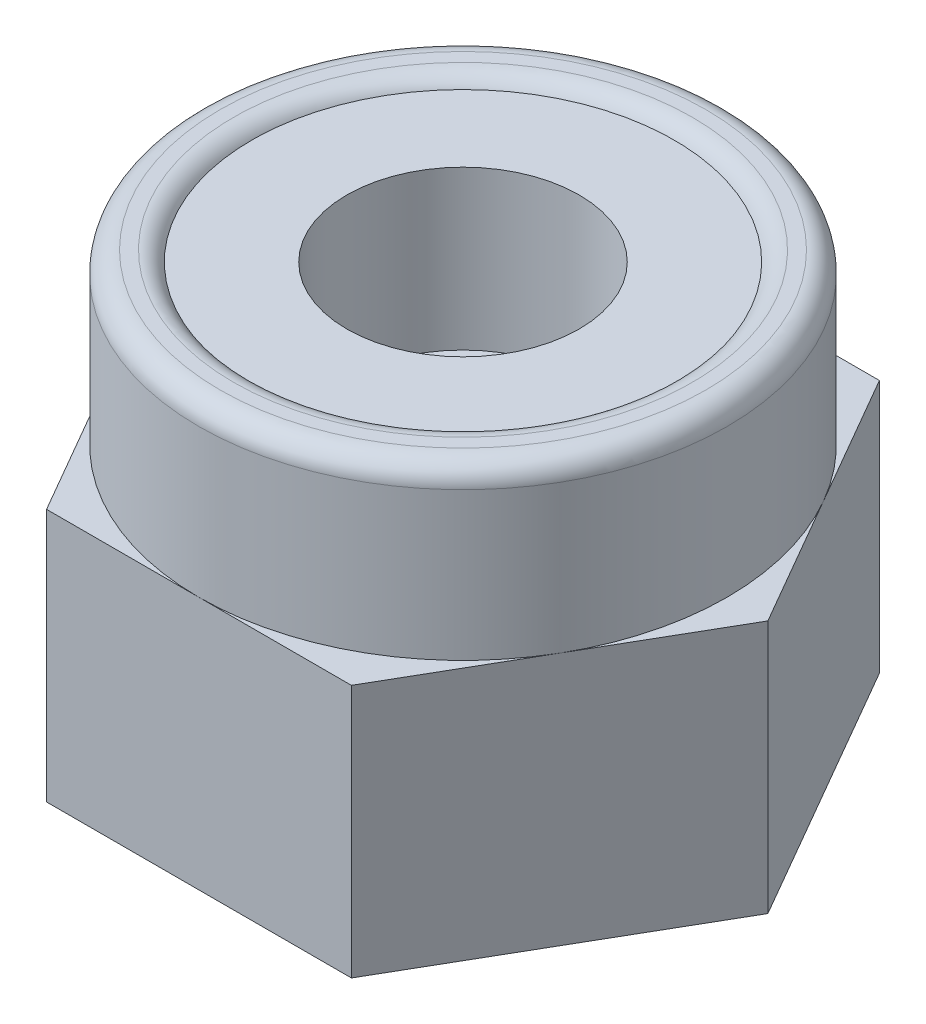
ISO-10303-21;
HEADER;
FILE_DESCRIPTION(('STEP AP214'),'2;1');
FILE_NAME('part.step','',(''),(''),'','','');
FILE_SCHEMA(('AUTOMOTIVE_DESIGN { 1 0 10303 214 1 1 1 1 }'));
ENDSEC;
DATA;
#1=APPLICATION_CONTEXT('core data for automotive mechanical design processes');
#2=APPLICATION_PROTOCOL_DEFINITION('international standard','automotive_design',2000,#1);
#3=PRODUCT_CONTEXT('',#1,'mechanical');
#4=PRODUCT('Part','Part','',(#3));
#5=PRODUCT_RELATED_PRODUCT_CATEGORY('part','',(#4));
#6=PRODUCT_DEFINITION_FORMATION('','',#4);
#7=PRODUCT_DEFINITION_CONTEXT('part definition',#1,'design');
#8=PRODUCT_DEFINITION('design','',#6,#7);
#9=PRODUCT_DEFINITION_SHAPE('','',#8);
#10=(LENGTH_UNIT() NAMED_UNIT(*) SI_UNIT(.MILLI.,.METRE.));
#11=(NAMED_UNIT(*) PLANE_ANGLE_UNIT() SI_UNIT($,.RADIAN.));
#12=(NAMED_UNIT(*) SI_UNIT($,.STERADIAN.) SOLID_ANGLE_UNIT());
#13=UNCERTAINTY_MEASURE_WITH_UNIT(LENGTH_MEASURE(1.E-05),#10,'distance_accuracy_value','');
#14=(GEOMETRIC_REPRESENTATION_CONTEXT(3) GLOBAL_UNCERTAINTY_ASSIGNED_CONTEXT((#13)) GLOBAL_UNIT_ASSIGNED_CONTEXT((#10,
#11,#12)) REPRESENTATION_CONTEXT('',''));
#15=CARTESIAN_POINT('',(0.,0.,0.));
#16=DIRECTION('',(0.,0.,1.));
#17=DIRECTION('',(1.,0.,0.));
#18=AXIS2_PLACEMENT_3D('',#15,#16,#17);
#19=CARTESIAN_POINT('',(0.,4.,0.));
#20=DIRECTION('',(0.,-1.,0.));
#21=DIRECTION('',(0.,0.,-1.));
#22=AXIS2_PLACEMENT_3D('',#19,#20,#21);
#23=CYLINDRICAL_SURFACE('',#22,1.1);
#24=CARTESIAN_POINT('',(0.,2.4,0.));
#25=DIRECTION('',(0.,1.,0.));
#26=DIRECTION('',(0.,0.,1.));
#27=AXIS2_PLACEMENT_3D('',#24,#25,#26);
#28=CIRCLE('',#27,1.1);
#29=CARTESIAN_POINT('',(0.,2.4,1.1));
#30=VERTEX_POINT('',#29);
#31=EDGE_CURVE('E134',#30,#30,#28,.T.);
#32=ORIENTED_EDGE('',*,*,#31,.F.);
#33=EDGE_LOOP('',(#32));
#34=FACE_BOUND('',#33,.T.);
#35=CARTESIAN_POINT('',(0.,3.9,0.));
#36=DIRECTION('',(0.,1.,0.));
#37=DIRECTION('',(0.,0.,1.));
#38=AXIS2_PLACEMENT_3D('',#35,#36,#37);
#39=CIRCLE('',#38,1.1);
#40=CARTESIAN_POINT('',(0.,3.9,1.1));
#41=VERTEX_POINT('',#40);
#42=EDGE_CURVE('E411',#41,#41,#39,.T.);
#43=ORIENTED_EDGE('',*,*,#42,.T.);
#44=EDGE_LOOP('',(#43));
#45=FACE_BOUND('',#44,.T.);
#46=ADVANCED_FACE('F34',(#34,#45),#23,.F.);
#47=CARTESIAN_POINT('',(-1.44337567297406,2.4,-2.5));
#48=DIRECTION('',(0.,1.,0.));
#49=DIRECTION('',(0.,0.,1.));
#50=AXIS2_PLACEMENT_3D('',#47,#48,#49);
#51=PLANE('',#50);
#52=CARTESIAN_POINT('',(0.,2.4,0.));
#53=DIRECTION('',(0.,1.,0.));
#54=DIRECTION('',(0.,0.,1.));
#55=AXIS2_PLACEMENT_3D('',#52,#53,#54);
#56=CIRCLE('',#55,2.5);
#57=CARTESIAN_POINT('',(0.,2.4,2.5));
#58=VERTEX_POINT('',#57);
#59=CARTESIAN_POINT('',(2.1650635094611,2.4,1.25));
#60=VERTEX_POINT('',#59);
#61=EDGE_CURVE('E129',#58,#60,#56,.T.);
#62=ORIENTED_EDGE('',*,*,#61,.F.);
#63=DIRECTION('',(1.,0.,0.));
#64=VECTOR('',#63,1.);
#65=CARTESIAN_POINT('',(-1.44337567297407,2.4,2.5));
#66=LINE('',#65,#64);
#67=CARTESIAN_POINT('',(1.44337567297406,2.4,2.5));
#68=VERTEX_POINT('',#67);
#69=EDGE_CURVE('E117',#58,#68,#66,.T.);
#70=ORIENTED_EDGE('',*,*,#69,.T.);
#71=DIRECTION('',(0.5,0.,-0.866025403784439));
#72=VECTOR('',#71,1.);
#73=CARTESIAN_POINT('',(1.44337567297406,2.4,2.5));
#74=LINE('',#73,#72);
#75=EDGE_CURVE('E131',#68,#60,#74,.T.);
#76=ORIENTED_EDGE('',*,*,#75,.T.);
#77=EDGE_LOOP('',(#62,#70,#76));
#78=FACE_BOUND('',#77,.T.);
#79=ADVANCED_FACE('F130',(#78),#51,.T.);
#80=CARTESIAN_POINT('',(2.1650635094611,2.4,-1.25));
#81=VERTEX_POINT('',#80);
#82=EDGE_CURVE('E57',#60,#81,#56,.T.);
#83=ORIENTED_EDGE('',*,*,#82,.F.);
#84=CARTESIAN_POINT('',(2.88675134594813,2.4,0.));
#85=VERTEX_POINT('',#84);
#86=EDGE_CURVE('E116',#60,#85,#74,.T.);
#87=ORIENTED_EDGE('',*,*,#86,.T.);
#88=DIRECTION('',(-0.5,0.,-0.866025403784439));
#89=VECTOR('',#88,1.);
#90=CARTESIAN_POINT('',(2.88675134594813,2.4,0.));
#91=LINE('',#90,#89);
#92=EDGE_CURVE('E165',#85,#81,#91,.T.);
#93=ORIENTED_EDGE('',*,*,#92,.T.);
#94=EDGE_LOOP('',(#83,#87,#93));
#95=FACE_BOUND('',#94,.T.);
#96=ADVANCED_FACE('F217',(#95),#51,.T.);
#97=CARTESIAN_POINT('',(0.,2.4,-2.5));
#98=VERTEX_POINT('',#97);
#99=EDGE_CURVE('E49',#81,#98,#56,.T.);
#100=ORIENTED_EDGE('',*,*,#99,.F.);
#101=CARTESIAN_POINT('',(1.44337567297407,2.4,-2.5));
#102=VERTEX_POINT('',#101);
#103=EDGE_CURVE('E164',#81,#102,#91,.T.);
#104=ORIENTED_EDGE('',*,*,#103,.T.);
#105=DIRECTION('',(-1.,0.,0.));
#106=VECTOR('',#105,1.);
#107=CARTESIAN_POINT('',(1.44337567297407,2.4,-2.5));
#108=LINE('',#107,#106);
#109=EDGE_CURVE('E154',#102,#98,#108,.T.);
#110=ORIENTED_EDGE('',*,*,#109,.T.);
#111=EDGE_LOOP('',(#100,#104,#110));
#112=FACE_BOUND('',#111,.T.);
#113=ADVANCED_FACE('F274',(#112),#51,.T.);
#114=CARTESIAN_POINT('',(-2.1650635094611,2.4,-1.25));
#115=VERTEX_POINT('',#114);
#116=EDGE_CURVE('E141',#98,#115,#56,.T.);
#117=ORIENTED_EDGE('',*,*,#116,.F.);
#118=CARTESIAN_POINT('',(-1.44337567297406,2.4,-2.5));
#119=VERTEX_POINT('',#118);
#120=EDGE_CURVE('E157',#98,#119,#108,.T.);
#121=ORIENTED_EDGE('',*,*,#120,.T.);
#122=DIRECTION('',(-0.5,0.,0.866025403784439));
#123=VECTOR('',#122,1.);
#124=CARTESIAN_POINT('',(-1.44337567297406,2.4,-2.5));
#125=LINE('',#124,#123);
#126=EDGE_CURVE('E158',#119,#115,#125,.T.);
#127=ORIENTED_EDGE('',*,*,#126,.T.);
#128=EDGE_LOOP('',(#117,#121,#127));
#129=FACE_BOUND('',#128,.T.);
#130=ADVANCED_FACE('F273',(#129),#51,.T.);
#131=CARTESIAN_POINT('',(-2.1650635094611,2.4,1.25));
#132=VERTEX_POINT('',#131);
#133=EDGE_CURVE('E139',#115,#132,#56,.T.);
#134=ORIENTED_EDGE('',*,*,#133,.F.);
#135=CARTESIAN_POINT('',(-2.88675134594813,2.4,0.));
#136=VERTEX_POINT('',#135);
#137=EDGE_CURVE('E156',#115,#136,#125,.T.);
#138=ORIENTED_EDGE('',*,*,#137,.T.);
#139=DIRECTION('',(0.5,0.,0.866025403784439));
#140=VECTOR('',#139,1.);
#141=CARTESIAN_POINT('',(-2.88675134594813,2.4,0.));
#142=LINE('',#141,#140);
#143=EDGE_CURVE('E127',#136,#132,#142,.T.);
#144=ORIENTED_EDGE('',*,*,#143,.T.);
#145=EDGE_LOOP('',(#134,#138,#144));
#146=FACE_BOUND('',#145,.T.);
#147=ADVANCED_FACE('F279',(#146),#51,.T.);
#148=CARTESIAN_POINT('',(0.,2.4,0.));
#149=DIRECTION('',(0.,1.,0.));
#150=DIRECTION('',(0.,0.,1.));
#151=AXIS2_PLACEMENT_3D('',#148,#149,#150);
#152=CIRCLE('',#151,1.);
#153=CARTESIAN_POINT('',(0.,2.4,1.));
#154=VERTEX_POINT('',#153);
#155=EDGE_CURVE('E148',#154,#154,#152,.T.);
#156=ORIENTED_EDGE('',*,*,#155,.F.);
#157=EDGE_LOOP('',(#156));
#158=FACE_BOUND('',#157,.T.);
#159=ORIENTED_EDGE('',*,*,#31,.T.);
#160=EDGE_LOOP('',(#159));
#161=FACE_BOUND('',#160,.T.);
#162=ADVANCED_FACE('F234',(#158,#161),#51,.T.);
#163=EDGE_CURVE('E110',#132,#58,#56,.T.);
#164=ORIENTED_EDGE('',*,*,#163,.F.);
#165=CARTESIAN_POINT('',(-1.44337567297407,2.4,2.5));
#166=VERTEX_POINT('',#165);
#167=EDGE_CURVE('E112',#132,#166,#142,.T.);
#168=ORIENTED_EDGE('',*,*,#167,.T.);
#169=EDGE_CURVE('E106',#166,#58,#66,.T.);
#170=ORIENTED_EDGE('',*,*,#169,.T.);
#171=EDGE_LOOP('',(#164,#168,#170));
#172=FACE_BOUND('',#171,.T.);
#173=ADVANCED_FACE('F108',(#172),#51,.T.);
#174=CARTESIAN_POINT('',(-1.44337567297406,0.,-2.5));
#175=DIRECTION('',(0.,1.,0.));
#176=DIRECTION('',(0.,0.,1.));
#177=AXIS2_PLACEMENT_3D('',#174,#175,#176);
#178=PLANE('',#177);
#179=DIRECTION('',(-1.,0.,0.));
#180=VECTOR('',#179,1.);
#181=CARTESIAN_POINT('',(1.44337567297407,0.,-2.5));
#182=LINE('',#181,#180);
#183=CARTESIAN_POINT('',(1.44337567297407,0.,-2.5));
#184=VERTEX_POINT('',#183);
#185=CARTESIAN_POINT('',(-1.44337567297406,0.,-2.5));
#186=VERTEX_POINT('',#185);
#187=EDGE_CURVE('E151',#184,#186,#182,.T.);
#188=ORIENTED_EDGE('',*,*,#187,.F.);
#189=DIRECTION('',(-0.5,0.,-0.866025403784439));
#190=VECTOR('',#189,1.);
#191=CARTESIAN_POINT('',(2.88675134594813,0.,0.));
#192=LINE('',#191,#190);
#193=CARTESIAN_POINT('',(2.88675134594813,0.,0.));
#194=VERTEX_POINT('',#193);
#195=EDGE_CURVE('E178',#194,#184,#192,.T.);
#196=ORIENTED_EDGE('',*,*,#195,.F.);
#197=DIRECTION('',(0.5,0.,-0.866025403784439));
#198=VECTOR('',#197,1.);
#199=CARTESIAN_POINT('',(1.44337567297406,0.,2.5));
#200=LINE('',#199,#198);
#201=CARTESIAN_POINT('',(1.44337567297406,0.,2.5));
#202=VERTEX_POINT('',#201);
#203=EDGE_CURVE('E176',#202,#194,#200,.T.);
#204=ORIENTED_EDGE('',*,*,#203,.F.);
#205=DIRECTION('',(1.,0.,0.));
#206=VECTOR('',#205,1.);
#207=CARTESIAN_POINT('',(-1.44337567297407,0.,2.5));
#208=LINE('',#207,#206);
#209=CARTESIAN_POINT('',(-1.44337567297407,0.,2.5));
#210=VERTEX_POINT('',#209);
#211=EDGE_CURVE('E174',#210,#202,#208,.T.);
#212=ORIENTED_EDGE('',*,*,#211,.F.);
#213=DIRECTION('',(0.5,0.,0.866025403784439));
#214=VECTOR('',#213,1.);
#215=CARTESIAN_POINT('',(-2.88675134594813,0.,0.));
#216=LINE('',#215,#214);
#217=CARTESIAN_POINT('',(-2.88675134594813,0.,0.));
#218=VERTEX_POINT('',#217);
#219=EDGE_CURVE('E172',#218,#210,#216,.T.);
#220=ORIENTED_EDGE('',*,*,#219,.F.);
#221=DIRECTION('',(-0.5,0.,0.866025403784439));
#222=VECTOR('',#221,1.);
#223=CARTESIAN_POINT('',(-1.44337567297406,0.,-2.5));
#224=LINE('',#223,#222);
#225=EDGE_CURVE('E170',#186,#218,#224,.T.);
#226=ORIENTED_EDGE('',*,*,#225,.F.);
#227=EDGE_LOOP('',(#188,#196,#204,#212,#220,#226));
#228=FACE_BOUND('',#227,.T.);
#229=CARTESIAN_POINT('',(0.,0.,0.));
#230=DIRECTION('',(0.,1.,0.));
#231=DIRECTION('',(0.,0.,1.));
#232=AXIS2_PLACEMENT_3D('',#229,#230,#231);
#233=CIRCLE('',#232,1.);
#234=CARTESIAN_POINT('',(0.,0.,1.));
#235=VERTEX_POINT('',#234);
#236=EDGE_CURVE('E133',#235,#235,#233,.T.);
#237=ORIENTED_EDGE('',*,*,#236,.T.);
#238=EDGE_LOOP('',(#237));
#239=FACE_BOUND('',#238,.T.);
#240=ADVANCED_FACE('F233',(#228,#239),#178,.F.);
#241=CARTESIAN_POINT('',(1.44337567297407,2.4,-2.5));
#242=DIRECTION('',(0.,0.,1.));
#243=DIRECTION('',(1.,0.,0.));
#244=AXIS2_PLACEMENT_3D('',#241,#242,#243);
#245=PLANE('',#244);
#246=ORIENTED_EDGE('',*,*,#187,.T.);
#247=DIRECTION('',(0.,-1.,0.));
#248=VECTOR('',#247,1.);
#249=CARTESIAN_POINT('',(-1.44337567297406,2.4,-2.5));
#250=LINE('',#249,#248);
#251=EDGE_CURVE('E140',#119,#186,#250,.T.);
#252=ORIENTED_EDGE('',*,*,#251,.F.);
#253=ORIENTED_EDGE('',*,*,#120,.F.);
#254=ORIENTED_EDGE('',*,*,#109,.F.);
#255=DIRECTION('',(0.,-1.,0.));
#256=VECTOR('',#255,1.);
#257=CARTESIAN_POINT('',(1.44337567297407,2.4,-2.5));
#258=LINE('',#257,#256);
#259=EDGE_CURVE('E167',#102,#184,#258,.T.);
#260=ORIENTED_EDGE('',*,*,#259,.T.);
#261=EDGE_LOOP('',(#246,#252,#253,#254,#260));
#262=FACE_BOUND('',#261,.T.);
#263=ADVANCED_FACE('F237',(#262),#245,.F.);
#264=CARTESIAN_POINT('',(-1.44337567297406,2.4,-2.5));
#265=DIRECTION('',(0.866025403784439,0.,0.5));
#266=DIRECTION('',(0.5,0.,-0.866025403784439));
#267=AXIS2_PLACEMENT_3D('',#264,#265,#266);
#268=PLANE('',#267);
#269=ORIENTED_EDGE('',*,*,#225,.T.);
#270=DIRECTION('',(0.,-1.,0.));
#271=VECTOR('',#270,1.);
#272=CARTESIAN_POINT('',(-2.88675134594813,2.4,0.));
#273=LINE('',#272,#271);
#274=EDGE_CURVE('E143',#136,#218,#273,.T.);
#275=ORIENTED_EDGE('',*,*,#274,.F.);
#276=ORIENTED_EDGE('',*,*,#137,.F.);
#277=ORIENTED_EDGE('',*,*,#126,.F.);
#278=ORIENTED_EDGE('',*,*,#251,.T.);
#279=EDGE_LOOP('',(#269,#275,#276,#277,#278));
#280=FACE_BOUND('',#279,.T.);
#281=ADVANCED_FACE('F251',(#280),#268,.F.);
#282=CARTESIAN_POINT('',(-2.88675134594813,2.4,0.));
#283=DIRECTION('',(0.866025403784439,0.,-0.5));
#284=DIRECTION('',(-0.5,0.,-0.866025403784439));
#285=AXIS2_PLACEMENT_3D('',#282,#283,#284);
#286=PLANE('',#285);
#287=ORIENTED_EDGE('',*,*,#219,.T.);
#288=DIRECTION('',(0.,-1.,0.));
#289=VECTOR('',#288,1.);
#290=CARTESIAN_POINT('',(-1.44337567297407,2.4,2.5));
#291=LINE('',#290,#289);
#292=EDGE_CURVE('E186',#166,#210,#291,.T.);
#293=ORIENTED_EDGE('',*,*,#292,.F.);
#294=ORIENTED_EDGE('',*,*,#167,.F.);
#295=ORIENTED_EDGE('',*,*,#143,.F.);
#296=ORIENTED_EDGE('',*,*,#274,.T.);
#297=EDGE_LOOP('',(#287,#293,#294,#295,#296));
#298=FACE_BOUND('',#297,.T.);
#299=ADVANCED_FACE('F248',(#298),#286,.F.);
#300=CARTESIAN_POINT('',(-1.44337567297407,2.4,2.5));
#301=DIRECTION('',(0.,0.,-1.));
#302=DIRECTION('',(-1.,0.,0.));
#303=AXIS2_PLACEMENT_3D('',#300,#301,#302);
#304=PLANE('',#303);
#305=ORIENTED_EDGE('',*,*,#211,.T.);
#306=DIRECTION('',(0.,-1.,0.));
#307=VECTOR('',#306,1.);
#308=CARTESIAN_POINT('',(1.44337567297406,2.4,2.5));
#309=LINE('',#308,#307);
#310=EDGE_CURVE('E123',#68,#202,#309,.T.);
#311=ORIENTED_EDGE('',*,*,#310,.F.);
#312=ORIENTED_EDGE('',*,*,#69,.F.);
#313=ORIENTED_EDGE('',*,*,#169,.F.);
#314=ORIENTED_EDGE('',*,*,#292,.T.);
#315=EDGE_LOOP('',(#305,#311,#312,#313,#314));
#316=FACE_BOUND('',#315,.T.);
#317=ADVANCED_FACE('F121',(#316),#304,.F.);
#318=CARTESIAN_POINT('',(1.44337567297406,2.4,2.5));
#319=DIRECTION('',(-0.866025403784439,0.,-0.5));
#320=DIRECTION('',(-0.5,0.,0.866025403784439));
#321=AXIS2_PLACEMENT_3D('',#318,#319,#320);
#322=PLANE('',#321);
#323=ORIENTED_EDGE('',*,*,#203,.T.);
#324=DIRECTION('',(0.,-1.,0.));
#325=VECTOR('',#324,1.);
#326=CARTESIAN_POINT('',(2.88675134594813,2.4,0.));
#327=LINE('',#326,#325);
#328=EDGE_CURVE('E182',#85,#194,#327,.T.);
#329=ORIENTED_EDGE('',*,*,#328,.F.);
#330=ORIENTED_EDGE('',*,*,#86,.F.);
#331=ORIENTED_EDGE('',*,*,#75,.F.);
#332=ORIENTED_EDGE('',*,*,#310,.T.);
#333=EDGE_LOOP('',(#323,#329,#330,#331,#332));
#334=FACE_BOUND('',#333,.T.);
#335=ADVANCED_FACE('F241',(#334),#322,.F.);
#336=CARTESIAN_POINT('',(2.88675134594813,2.4,0.));
#337=DIRECTION('',(-0.866025403784439,0.,0.5));
#338=DIRECTION('',(0.5,0.,0.866025403784439));
#339=AXIS2_PLACEMENT_3D('',#336,#337,#338);
#340=PLANE('',#339);
#341=ORIENTED_EDGE('',*,*,#195,.T.);
#342=ORIENTED_EDGE('',*,*,#259,.F.);
#343=ORIENTED_EDGE('',*,*,#103,.F.);
#344=ORIENTED_EDGE('',*,*,#92,.F.);
#345=ORIENTED_EDGE('',*,*,#328,.T.);
#346=EDGE_LOOP('',(#341,#342,#343,#344,#345));
#347=FACE_BOUND('',#346,.T.);
#348=ADVANCED_FACE('F229',(#347),#340,.F.);
#349=CARTESIAN_POINT('',(0.,2.4,0.));
#350=DIRECTION('',(0.,-1.,0.));
#351=DIRECTION('',(0.,0.,-1.));
#352=AXIS2_PLACEMENT_3D('',#349,#350,#351);
#353=CYLINDRICAL_SURFACE('',#352,1.);
#354=ORIENTED_EDGE('',*,*,#155,.T.);
#355=EDGE_LOOP('',(#354));
#356=FACE_BOUND('',#355,.T.);
#357=ORIENTED_EDGE('',*,*,#236,.F.);
#358=EDGE_LOOP('',(#357));
#359=FACE_BOUND('',#358,.T.);
#360=ADVANCED_FACE('F224',(#356,#359),#353,.F.);
#361=CARTESIAN_POINT('',(0.,4.,0.));
#362=DIRECTION('',(0.,1.,0.));
#363=DIRECTION('',(0.,0.,1.));
#364=AXIS2_PLACEMENT_3D('',#361,#362,#363);
#365=PLANE('',#364);
#366=CARTESIAN_POINT('',(0.,4.,0.));
#367=DIRECTION('',(0.,1.,0.));
#368=DIRECTION('',(0.,0.,1.));
#369=AXIS2_PLACEMENT_3D('',#366,#367,#368);
#370=CIRCLE('',#369,2.3);
#371=CARTESIAN_POINT('',(0.,4.,2.3));
#372=VERTEX_POINT('',#371);
#373=EDGE_CURVE('E42',#372,#372,#370,.T.);
#374=ORIENTED_EDGE('',*,*,#373,.T.);
#375=EDGE_LOOP('',(#374));
#376=FACE_BOUND('',#375,.T.);
#377=CARTESIAN_POINT('',(0.,4.,0.));
#378=DIRECTION('',(0.,1.,0.));
#379=DIRECTION('',(0.,0.,1.));
#380=AXIS2_PLACEMENT_3D('',#377,#378,#379);
#381=CIRCLE('',#380,2.17320508075689);
#382=CARTESIAN_POINT('',(0.,4.,2.17320508075689));
#383=VERTEX_POINT('',#382);
#384=EDGE_CURVE('E190',#383,#383,#381,.F.);
#385=ORIENTED_EDGE('',*,*,#384,.T.);
#386=EDGE_LOOP('',(#385));
#387=FACE_BOUND('',#386,.T.);
#388=ADVANCED_FACE('F195',(#376,#387),#365,.T.);
#389=CARTESIAN_POINT('',(0.,4.,0.));
#390=DIRECTION('',(0.,-1.,0.));
#391=DIRECTION('',(0.,0.,-1.));
#392=AXIS2_PLACEMENT_3D('',#389,#390,#391);
#393=CYLINDRICAL_SURFACE('',#392,2.5);
#394=CARTESIAN_POINT('',(0.,3.8,0.));
#395=DIRECTION('',(0.,1.,0.));
#396=DIRECTION('',(0.,0.,1.));
#397=AXIS2_PLACEMENT_3D('',#394,#395,#396);
#398=CIRCLE('',#397,2.5);
#399=CARTESIAN_POINT('',(0.,3.8,2.5));
#400=VERTEX_POINT('',#399);
#401=EDGE_CURVE('E11',#400,#400,#398,.F.);
#402=ORIENTED_EDGE('',*,*,#401,.T.);
#403=EDGE_LOOP('',(#402));
#404=FACE_BOUND('',#403,.T.);
#405=ORIENTED_EDGE('',*,*,#61,.T.);
#406=ORIENTED_EDGE('',*,*,#82,.T.);
#407=ORIENTED_EDGE('',*,*,#99,.T.);
#408=ORIENTED_EDGE('',*,*,#116,.T.);
#409=ORIENTED_EDGE('',*,*,#133,.T.);
#410=ORIENTED_EDGE('',*,*,#163,.T.);
#411=EDGE_LOOP('',(#405,#406,#407,#408,#409,#410));
#412=FACE_BOUND('',#411,.T.);
#413=ADVANCED_FACE('F137',(#404,#412),#393,.T.);
#414=CARTESIAN_POINT('',(0.,3.9,0.));
#415=DIRECTION('',(0.,1.,0.));
#416=DIRECTION('',(0.,0.,1.));
#417=AXIS2_PLACEMENT_3D('',#414,#415,#416);
#418=PLANE('',#417);
#419=ORIENTED_EDGE('',*,*,#42,.F.);
#420=EDGE_LOOP('',(#419));
#421=FACE_BOUND('',#420,.T.);
#422=CARTESIAN_POINT('',(0.,3.9,0.));
#423=DIRECTION('',(0.,1.,0.));
#424=DIRECTION('',(0.,0.,1.));
#425=AXIS2_PLACEMENT_3D('',#422,#423,#424);
#426=CIRCLE('',#425,2.);
#427=CARTESIAN_POINT('',(0.,3.9,2.));
#428=VERTEX_POINT('',#427);
#429=EDGE_CURVE('E409',#428,#428,#426,.T.);
#430=ORIENTED_EDGE('',*,*,#429,.T.);
#431=EDGE_LOOP('',(#430));
#432=FACE_BOUND('',#431,.T.);
#433=ADVANCED_FACE('F200',(#421,#432),#418,.T.);
#434=CARTESIAN_POINT('',(0.,3.8,0.));
#435=DIRECTION('',(0.,1.,0.));
#436=DIRECTION('',(0.,0.,1.));
#437=AXIS2_PLACEMENT_3D('',#434,#435,#436);
#438=TOROIDAL_SURFACE('',#437,2.3,0.2);
#439=ORIENTED_EDGE('',*,*,#401,.F.);
#440=EDGE_LOOP('',(#439));
#441=FACE_BOUND('',#440,.T.);
#442=ORIENTED_EDGE('',*,*,#373,.F.);
#443=EDGE_LOOP('',(#442));
#444=FACE_BOUND('',#443,.T.);
#445=ADVANCED_FACE('F198',(#441,#444),#438,.T.);
#446=CARTESIAN_POINT('',(0.,3.8,0.));
#447=DIRECTION('',(0.,1.,0.));
#448=DIRECTION('',(0.,0.,1.));
#449=AXIS2_PLACEMENT_3D('',#446,#447,#448);
#450=TOROIDAL_SURFACE('',#449,2.17320508075689,0.2);
#451=ORIENTED_EDGE('',*,*,#384,.F.);
#452=EDGE_LOOP('',(#451));
#453=FACE_BOUND('',#452,.T.);
#454=ORIENTED_EDGE('',*,*,#429,.F.);
#455=EDGE_LOOP('',(#454));
#456=FACE_BOUND('',#455,.T.);
#457=ADVANCED_FACE('F36',(#453,#456),#450,.T.);
#458=CLOSED_SHELL('',(#46,#79,#96,#113,#130,#147,#162,#173,#240,#263,#281,#299,#317,#335,#348,
#360,#388,#413,#433,#445,#457));
#459=MANIFOLD_SOLID_BREP('B2',#458);
#460=ADVANCED_BREP_SHAPE_REPRESENTATION('',(#18,#459),#14);
#461=SHAPE_DEFINITION_REPRESENTATION(#9,#460);
ENDSEC;
END-ISO-10303-21;
